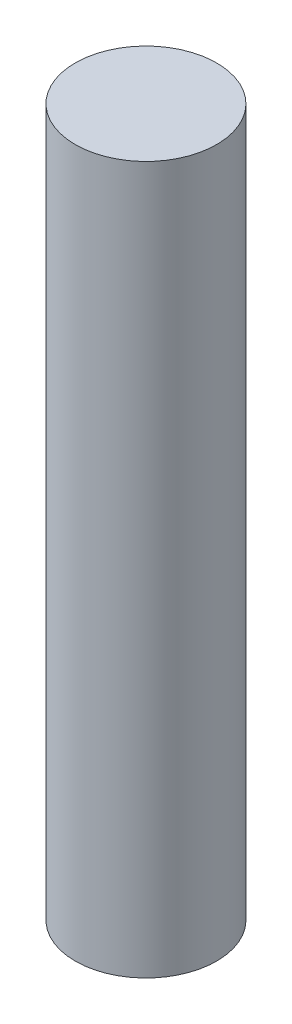
ISO-10303-21;
HEADER;
FILE_DESCRIPTION(('STEP AP214'),'2;1');
FILE_NAME('part.step','',(''),(''),'','','');
FILE_SCHEMA(('AUTOMOTIVE_DESIGN { 1 0 10303 214 1 1 1 1 }'));
ENDSEC;
DATA;
#1=APPLICATION_CONTEXT('core data for automotive mechanical design processes');
#2=APPLICATION_PROTOCOL_DEFINITION('international standard','automotive_design',2000,#1);
#3=PRODUCT_CONTEXT('',#1,'mechanical');
#4=PRODUCT('Part','Part','',(#3));
#5=PRODUCT_RELATED_PRODUCT_CATEGORY('part','',(#4));
#6=PRODUCT_DEFINITION_FORMATION('','',#4);
#7=PRODUCT_DEFINITION_CONTEXT('part definition',#1,'design');
#8=PRODUCT_DEFINITION('design','',#6,#7);
#9=PRODUCT_DEFINITION_SHAPE('','',#8);
#10=(LENGTH_UNIT() NAMED_UNIT(*) SI_UNIT(.MILLI.,.METRE.));
#11=(NAMED_UNIT(*) PLANE_ANGLE_UNIT() SI_UNIT($,.RADIAN.));
#12=(NAMED_UNIT(*) SI_UNIT($,.STERADIAN.) SOLID_ANGLE_UNIT());
#13=UNCERTAINTY_MEASURE_WITH_UNIT(LENGTH_MEASURE(1.E-05),#10,'distance_accuracy_value','');
#14=(GEOMETRIC_REPRESENTATION_CONTEXT(3) GLOBAL_UNCERTAINTY_ASSIGNED_CONTEXT((#13)) GLOBAL_UNIT_ASSIGNED_CONTEXT((#10,
#11,#12)) REPRESENTATION_CONTEXT('',''));
#15=CARTESIAN_POINT('',(0.,0.,0.));
#16=DIRECTION('',(0.,0.,1.));
#17=DIRECTION('',(1.,0.,0.));
#18=AXIS2_PLACEMENT_3D('',#15,#16,#17);
#19=CARTESIAN_POINT('',(0.,15.,0.));
#20=DIRECTION('',(0.,-1.,0.));
#21=DIRECTION('',(0.,0.,-1.));
#22=AXIS2_PLACEMENT_3D('',#19,#20,#21);
#23=CYLINDRICAL_SURFACE('',#22,1.5);
#24=CARTESIAN_POINT('',(0.,15.,0.));
#25=DIRECTION('',(0.,1.,0.));
#26=DIRECTION('',(0.,0.,1.));
#27=AXIS2_PLACEMENT_3D('',#24,#25,#26);
#28=CIRCLE('',#27,1.5);
#29=CARTESIAN_POINT('',(0.,15.,1.5));
#30=VERTEX_POINT('',#29);
#31=EDGE_CURVE('E10',#30,#30,#28,.T.);
#32=ORIENTED_EDGE('',*,*,#31,.F.);
#33=EDGE_LOOP('',(#32));
#34=FACE_BOUND('',#33,.T.);
#35=CARTESIAN_POINT('',(0.,0.,0.));
#36=DIRECTION('',(0.,1.,0.));
#37=DIRECTION('',(0.,0.,1.));
#38=AXIS2_PLACEMENT_3D('',#35,#36,#37);
#39=CIRCLE('',#38,1.5);
#40=CARTESIAN_POINT('',(0.,0.,1.5));
#41=VERTEX_POINT('',#40);
#42=EDGE_CURVE('E34',#41,#41,#39,.T.);
#43=ORIENTED_EDGE('',*,*,#42,.T.);
#44=EDGE_LOOP('',(#43));
#45=FACE_BOUND('',#44,.T.);
#46=ADVANCED_FACE('F31',(#34,#45),#23,.T.);
#47=CARTESIAN_POINT('',(0.,15.,0.));
#48=DIRECTION('',(0.,1.,0.));
#49=DIRECTION('',(0.,0.,1.));
#50=AXIS2_PLACEMENT_3D('',#47,#48,#49);
#51=PLANE('',#50);
#52=ORIENTED_EDGE('',*,*,#31,.T.);
#53=EDGE_LOOP('',(#52));
#54=FACE_BOUND('',#53,.T.);
#55=ADVANCED_FACE('F46',(#54),#51,.T.);
#56=CARTESIAN_POINT('',(0.,0.,0.));
#57=DIRECTION('',(0.,1.,0.));
#58=DIRECTION('',(0.,0.,1.));
#59=AXIS2_PLACEMENT_3D('',#56,#57,#58);
#60=PLANE('',#59);
#61=ORIENTED_EDGE('',*,*,#42,.F.);
#62=EDGE_LOOP('',(#61));
#63=FACE_BOUND('',#62,.T.);
#64=ADVANCED_FACE('F44',(#63),#60,.F.);
#65=CLOSED_SHELL('',(#46,#55,#64));
#66=MANIFOLD_SOLID_BREP('B2',#65);
#67=ADVANCED_BREP_SHAPE_REPRESENTATION('',(#18,#66),#14);
#68=SHAPE_DEFINITION_REPRESENTATION(#9,#67);
ENDSEC;
END-ISO-10303-21;
